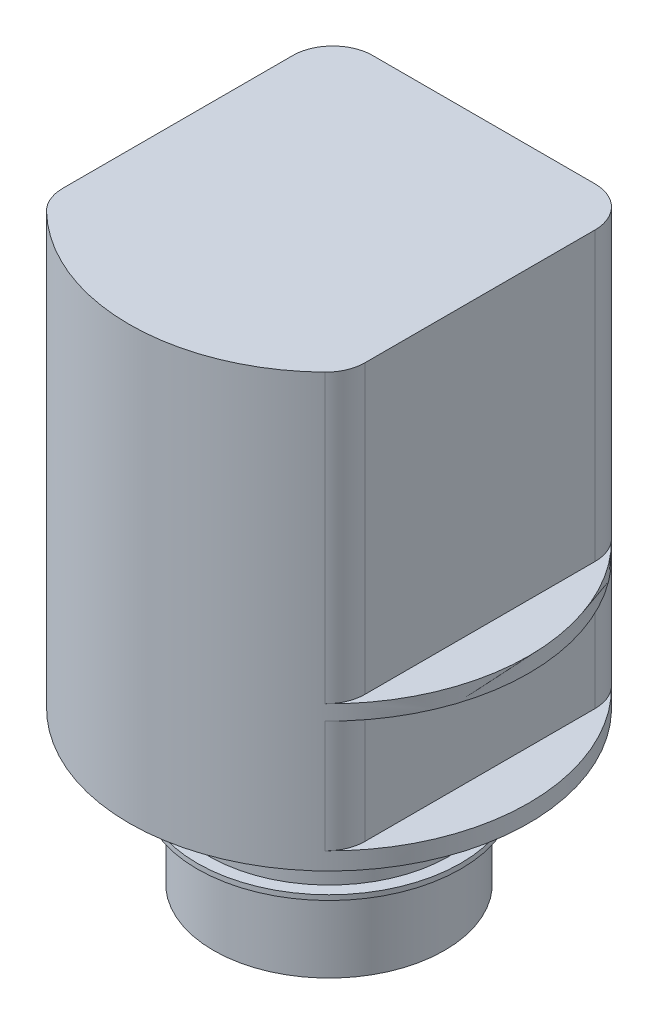
ISO-10303-21;
HEADER;
FILE_DESCRIPTION(('STEP AP214'),'2;1');
FILE_NAME('part.step','',(''),(''),'','','');
FILE_SCHEMA(('AUTOMOTIVE_DESIGN { 1 0 10303 214 1 1 1 1 }'));
ENDSEC;
DATA;
#1=APPLICATION_CONTEXT('core data for automotive mechanical design processes');
#2=APPLICATION_PROTOCOL_DEFINITION('international standard','automotive_design',2000,#1);
#3=PRODUCT_CONTEXT('',#1,'mechanical');
#4=PRODUCT('Part','Part','',(#3));
#5=PRODUCT_RELATED_PRODUCT_CATEGORY('part','',(#4));
#6=PRODUCT_DEFINITION_FORMATION('','',#4);
#7=PRODUCT_DEFINITION_CONTEXT('part definition',#1,'design');
#8=PRODUCT_DEFINITION('design','',#6,#7);
#9=PRODUCT_DEFINITION_SHAPE('','',#8);
#10=(LENGTH_UNIT() NAMED_UNIT(*) SI_UNIT(.MILLI.,.METRE.));
#11=(NAMED_UNIT(*) PLANE_ANGLE_UNIT() SI_UNIT($,.RADIAN.));
#12=(NAMED_UNIT(*) SI_UNIT($,.STERADIAN.) SOLID_ANGLE_UNIT());
#13=UNCERTAINTY_MEASURE_WITH_UNIT(LENGTH_MEASURE(1.E-05),#10,'distance_accuracy_value','');
#14=(GEOMETRIC_REPRESENTATION_CONTEXT(3) GLOBAL_UNCERTAINTY_ASSIGNED_CONTEXT((#13)) GLOBAL_UNIT_ASSIGNED_CONTEXT((#10,
#11,#12)) REPRESENTATION_CONTEXT('',''));
#15=CARTESIAN_POINT('',(0.,0.,0.));
#16=DIRECTION('',(0.,0.,1.));
#17=DIRECTION('',(1.,0.,0.));
#18=AXIS2_PLACEMENT_3D('',#15,#16,#17);
#19=CARTESIAN_POINT('',(0.,-17.272,0.));
#20=DIRECTION('',(0.,-1.,0.));
#21=DIRECTION('',(1.,0.,0.));
#22=AXIS2_PLACEMENT_3D('',#19,#20,#21);
#23=PLANE('',#22);
#24=CARTESIAN_POINT('',(0.,-17.272,0.));
#25=DIRECTION('',(0.,-1.,0.));
#26=DIRECTION('',(1.,0.,0.));
#27=AXIS2_PLACEMENT_3D('',#24,#25,#26);
#28=CIRCLE('',#27,11.7474999999999);
#29=CARTESIAN_POINT('',(11.7475,-17.2719999999999,0.));
#30=VERTEX_POINT('',#29);
#31=EDGE_CURVE('E20',#30,#30,#28,.F.);
#32=ORIENTED_EDGE('',*,*,#31,.F.);
#33=EDGE_LOOP('',(#32));
#34=FACE_BOUND('',#33,.T.);
#35=ADVANCED_FACE('F17',(#34),#23,.T.);
#36=CARTESIAN_POINT('',(3.49148133884313E-12,-1000.,0.));
#37=DIRECTION('',(0.,-1.,0.));
#38=DIRECTION('',(1.,0.,0.));
#39=AXIS2_PLACEMENT_3D('',#36,#37,#38);
#40=CYLINDRICAL_SURFACE('',#39,11.7474999999999);
#41=CARTESIAN_POINT('',(0.,-9.27100000000003,0.));
#42=DIRECTION('',(0.,-1.,0.));
#43=DIRECTION('',(1.,0.,0.));
#44=AXIS2_PLACEMENT_3D('',#41,#42,#43);
#45=CIRCLE('',#44,11.7474999999999);
#46=CARTESIAN_POINT('',(11.7475,-9.27099999999999,0.));
#47=VERTEX_POINT('',#46);
#48=EDGE_CURVE('E260',#47,#47,#45,.F.);
#49=ORIENTED_EDGE('',*,*,#48,.F.);
#50=EDGE_LOOP('',(#49));
#51=FACE_BOUND('',#50,.T.);
#52=ORIENTED_EDGE('',*,*,#31,.T.);
#53=EDGE_LOOP('',(#52));
#54=FACE_BOUND('',#53,.T.);
#55=ADVANCED_FACE('F267',(#51,#54),#40,.T.);
#56=CARTESIAN_POINT('',(13.3985,-9.27099999999999,0.));
#57=DIRECTION('',(0.,-1.,0.));
#58=DIRECTION('',(1.,0.,0.));
#59=AXIS2_PLACEMENT_3D('',#56,#57,#58);
#60=PLANE('',#59);
#61=ORIENTED_EDGE('',*,*,#48,.T.);
#62=EDGE_LOOP('',(#61));
#63=FACE_BOUND('',#62,.T.);
#64=CARTESIAN_POINT('',(0.,-9.27100000000003,0.));
#65=DIRECTION('',(0.,-1.,0.));
#66=DIRECTION('',(1.,0.,0.));
#67=AXIS2_PLACEMENT_3D('',#64,#65,#66);
#68=CIRCLE('',#67,13.3985);
#69=CARTESIAN_POINT('',(13.3985,-9.27099999999998,0.));
#70=VERTEX_POINT('',#69);
#71=EDGE_CURVE('E258',#70,#70,#68,.F.);
#72=ORIENTED_EDGE('',*,*,#71,.F.);
#73=EDGE_LOOP('',(#72));
#74=FACE_BOUND('',#73,.T.);
#75=ADVANCED_FACE('F274',(#63,#74),#60,.T.);
#76=CARTESIAN_POINT('',(3.49148133884313E-12,-1000.,0.));
#77=DIRECTION('',(0.,-1.,0.));
#78=DIRECTION('',(1.,0.,0.));
#79=AXIS2_PLACEMENT_3D('',#76,#77,#78);
#80=CYLINDRICAL_SURFACE('',#79,13.3985);
#81=CARTESIAN_POINT('',(0.,-8.76299999999997,0.));
#82=DIRECTION('',(0.,-1.,0.));
#83=DIRECTION('',(1.,0.,0.));
#84=AXIS2_PLACEMENT_3D('',#81,#82,#83);
#85=CIRCLE('',#84,13.3985);
#86=CARTESIAN_POINT('',(13.3985,-8.76299999999992,0.));
#87=VERTEX_POINT('',#86);
#88=EDGE_CURVE('E255',#87,#87,#85,.F.);
#89=ORIENTED_EDGE('',*,*,#88,.F.);
#90=EDGE_LOOP('',(#89));
#91=FACE_BOUND('',#90,.T.);
#92=ORIENTED_EDGE('',*,*,#71,.T.);
#93=EDGE_LOOP('',(#92));
#94=FACE_BOUND('',#93,.T.);
#95=ADVANCED_FACE('F372',(#91,#94),#80,.T.);
#96=CARTESIAN_POINT('',(13.3985,-8.763,0.));
#97=DIRECTION('',(0.,1.,0.));
#98=DIRECTION('',(-1.,0.,0.));
#99=AXIS2_PLACEMENT_3D('',#96,#97,#98);
#100=PLANE('',#99);
#101=ORIENTED_EDGE('',*,*,#88,.T.);
#102=EDGE_LOOP('',(#101));
#103=FACE_BOUND('',#102,.T.);
#104=CARTESIAN_POINT('',(0.,-8.76299999999997,0.));
#105=DIRECTION('',(0.,-1.,0.));
#106=DIRECTION('',(1.,0.,0.));
#107=AXIS2_PLACEMENT_3D('',#104,#105,#106);
#108=CIRCLE('',#107,12.192);
#109=CARTESIAN_POINT('',(12.192,-8.76299999999992,0.));
#110=VERTEX_POINT('',#109);
#111=EDGE_CURVE('E252',#110,#110,#108,.F.);
#112=ORIENTED_EDGE('',*,*,#111,.F.);
#113=EDGE_LOOP('',(#112));
#114=FACE_BOUND('',#113,.T.);
#115=ADVANCED_FACE('F368',(#103,#114),#100,.T.);
#116=CARTESIAN_POINT('',(3.49148133884313E-12,-1000.,0.));
#117=DIRECTION('',(0.,-1.,0.));
#118=DIRECTION('',(1.,0.,0.));
#119=AXIS2_PLACEMENT_3D('',#116,#117,#118);
#120=CYLINDRICAL_SURFACE('',#119,12.192);
#121=CARTESIAN_POINT('',(0.,-6.47699999999996,0.));
#122=DIRECTION('',(0.,-1.,0.));
#123=DIRECTION('',(1.,0.,0.));
#124=AXIS2_PLACEMENT_3D('',#121,#122,#123);
#125=CIRCLE('',#124,12.192);
#126=CARTESIAN_POINT('',(12.192,-6.47699999999991,0.));
#127=VERTEX_POINT('',#126);
#128=EDGE_CURVE('E249',#127,#127,#125,.F.);
#129=ORIENTED_EDGE('',*,*,#128,.F.);
#130=EDGE_LOOP('',(#129));
#131=FACE_BOUND('',#130,.T.);
#132=ORIENTED_EDGE('',*,*,#111,.T.);
#133=EDGE_LOOP('',(#132));
#134=FACE_BOUND('',#133,.T.);
#135=ADVANCED_FACE('F364',(#131,#134),#120,.T.);
#136=CARTESIAN_POINT('',(12.192,-6.477,0.));
#137=DIRECTION('',(0.,-1.,0.));
#138=DIRECTION('',(1.,0.,0.));
#139=AXIS2_PLACEMENT_3D('',#136,#137,#138);
#140=PLANE('',#139);
#141=ORIENTED_EDGE('',*,*,#128,.T.);
#142=EDGE_LOOP('',(#141));
#143=FACE_BOUND('',#142,.T.);
#144=CARTESIAN_POINT('',(0.,-6.47699999999996,0.));
#145=DIRECTION('',(0.,-1.,0.));
#146=DIRECTION('',(1.,0.,0.));
#147=AXIS2_PLACEMENT_3D('',#144,#145,#146);
#148=CIRCLE('',#147,13.3985);
#149=CARTESIAN_POINT('',(13.3985,-6.47699999999991,0.));
#150=VERTEX_POINT('',#149);
#151=EDGE_CURVE('E169',#150,#150,#148,.F.);
#152=ORIENTED_EDGE('',*,*,#151,.F.);
#153=EDGE_LOOP('',(#152));
#154=FACE_BOUND('',#153,.T.);
#155=ADVANCED_FACE('F360',(#143,#154),#140,.T.);
#156=CARTESIAN_POINT('',(3.49148133884313E-12,-1000.,0.));
#157=DIRECTION('',(0.,-1.,0.));
#158=DIRECTION('',(1.,0.,0.));
#159=AXIS2_PLACEMENT_3D('',#156,#157,#158);
#160=CYLINDRICAL_SURFACE('',#159,13.3985);
#161=ORIENTED_EDGE('',*,*,#151,.T.);
#162=EDGE_LOOP('',(#161));
#163=FACE_BOUND('',#162,.T.);
#164=CARTESIAN_POINT('',(0.,-1.77799999999995,0.));
#165=DIRECTION('',(0.,-1.,0.));
#166=DIRECTION('',(1.,0.,0.));
#167=AXIS2_PLACEMENT_3D('',#164,#165,#166);
#168=CIRCLE('',#167,13.3985);
#169=CARTESIAN_POINT('',(13.3985,-1.7779999999999,0.));
#170=VERTEX_POINT('',#169);
#171=EDGE_CURVE('E243',#170,#170,#168,.T.);
#172=ORIENTED_EDGE('',*,*,#171,.T.);
#173=EDGE_LOOP('',(#172));
#174=FACE_BOUND('',#173,.T.);
#175=ADVANCED_FACE('F356',(#163,#174),#160,.T.);
#176=CARTESIAN_POINT('',(15.3669999999999,42.164,-11.6828017801418));
#177=DIRECTION('',(-1.,0.,0.));
#178=DIRECTION('',(0.,0.,1.));
#179=AXIS2_PLACEMENT_3D('',#176,#177,#178);
#180=PLANE('',#179);
#181=DIRECTION('',(0.,-1.,0.));
#182=VECTOR('',#181,1.);
#183=CARTESIAN_POINT('',(15.367,42.164,11.7104103685568));
#184=LINE('',#183,#182);
#185=CARTESIAN_POINT('',(15.3669999999999,0.,11.7104103685568));
#186=VERTEX_POINT('',#185);
#187=CARTESIAN_POINT('',(15.3669999999999,11.43,11.7104103685568));
#188=VERTEX_POINT('',#187);
#189=EDGE_CURVE('E154',#186,#188,#184,.F.);
#190=ORIENTED_EDGE('',*,*,#189,.F.);
#191=DIRECTION('',(0.,0.,1.));
#192=VECTOR('',#191,1.);
#193=CARTESIAN_POINT('',(15.3669999999999,0.,0.));
#194=LINE('',#193,#192);
#195=CARTESIAN_POINT('',(15.3669999999999,0.,-11.6828017801418));
#196=VERTEX_POINT('',#195);
#197=EDGE_CURVE('E151',#196,#186,#194,.T.);
#198=ORIENTED_EDGE('',*,*,#197,.F.);
#199=DIRECTION('',(0.,-1.,0.));
#200=VECTOR('',#199,1.);
#201=CARTESIAN_POINT('',(15.3669999999999,42.164,-11.6828017801418));
#202=LINE('',#201,#200);
#203=CARTESIAN_POINT('',(15.3669999999999,11.43,-11.6828017801418));
#204=VERTEX_POINT('',#203);
#205=EDGE_CURVE('E175',#204,#196,#202,.T.);
#206=ORIENTED_EDGE('',*,*,#205,.F.);
#207=DIRECTION('',(0.,0.,1.));
#208=VECTOR('',#207,1.);
#209=CARTESIAN_POINT('',(15.3669999999999,11.43,-11.6828017801418));
#210=LINE('',#209,#208);
#211=EDGE_CURVE('E166',#204,#188,#210,.T.);
#212=ORIENTED_EDGE('',*,*,#211,.T.);
#213=EDGE_LOOP('',(#190,#198,#206,#212));
#214=FACE_BOUND('',#213,.T.);
#215=ADVANCED_FACE('F353',(#214),#180,.F.);
#216=CARTESIAN_POINT('',(0.,0.,0.));
#217=DIRECTION('',(0.,1.,0.));
#218=DIRECTION('',(0.,0.,1.));
#219=AXIS2_PLACEMENT_3D('',#216,#217,#218);
#220=PLANE('',#219);
#221=CARTESIAN_POINT('',(11.3018017801418,0.,-11.6828017801418));
#222=DIRECTION('',(0.,-1.,0.));
#223=DIRECTION('',(0.,0.,-1.));
#224=AXIS2_PLACEMENT_3D('',#221,#222,#223);
#225=CIRCLE('',#224,4.06519821985816);
#226=CARTESIAN_POINT('',(14.1282936130936,0.,-14.6045787197788));
#227=VERTEX_POINT('',#226);
#228=EDGE_CURVE('E177',#196,#227,#225,.F.);
#229=ORIENTED_EDGE('',*,*,#228,.F.);
#230=ORIENTED_EDGE('',*,*,#197,.T.);
#231=CARTESIAN_POINT('',(11.367,0.,11.7104103685568));
#232=DIRECTION('',(0.,-1.,0.));
#233=DIRECTION('',(0.,0.,-1.));
#234=AXIS2_PLACEMENT_3D('',#231,#232,#233);
#235=CIRCLE('',#234,4.00000000000001);
#236=CARTESIAN_POINT('',(14.1530294117646,0.,14.5806089883011));
#237=VERTEX_POINT('',#236);
#238=EDGE_CURVE('E148',#237,#186,#235,.F.);
#239=ORIENTED_EDGE('',*,*,#238,.F.);
#240=CARTESIAN_POINT('',(0.,0.,0.));
#241=DIRECTION('',(0.,-1.,0.));
#242=DIRECTION('',(0.,0.,-1.));
#243=AXIS2_PLACEMENT_3D('',#240,#241,#242);
#244=CIRCLE('',#243,20.32);
#245=EDGE_CURVE('E131',#227,#237,#244,.T.);
#246=ORIENTED_EDGE('',*,*,#245,.F.);
#247=EDGE_LOOP('',(#229,#230,#239,#246));
#248=FACE_BOUND('',#247,.T.);
#249=ADVANCED_FACE('F149',(#248),#220,.T.);
#250=CARTESIAN_POINT('',(11.367,42.164,11.7104103685568));
#251=DIRECTION('',(0.,-1.,0.));
#252=DIRECTION('',(0.,0.,-1.));
#253=AXIS2_PLACEMENT_3D('',#250,#251,#252);
#254=CYLINDRICAL_SURFACE('',#253,4.00000000000001);
#255=ORIENTED_EDGE('',*,*,#238,.T.);
#256=ORIENTED_EDGE('',*,*,#189,.T.);
#257=CARTESIAN_POINT('',(11.367,11.43,11.7104103685568));
#258=DIRECTION('',(0.,-1.,0.));
#259=DIRECTION('',(0.,0.,-1.));
#260=AXIS2_PLACEMENT_3D('',#257,#258,#259);
#261=CIRCLE('',#260,4.00000000000001);
#262=CARTESIAN_POINT('',(14.1530294117646,11.43,14.5806089883011));
#263=VERTEX_POINT('',#262);
#264=EDGE_CURVE('E158',#188,#263,#261,.T.);
#265=ORIENTED_EDGE('',*,*,#264,.T.);
#266=DIRECTION('',(0.,-1.,0.));
#267=VECTOR('',#266,1.);
#268=CARTESIAN_POINT('',(14.1530294117646,42.164,14.5806089883011));
#269=LINE('',#268,#267);
#270=EDGE_CURVE('E136',#237,#263,#269,.F.);
#271=ORIENTED_EDGE('',*,*,#270,.F.);
#272=EDGE_LOOP('',(#255,#256,#265,#271));
#273=FACE_BOUND('',#272,.T.);
#274=ADVANCED_FACE('F156',(#273),#254,.T.);
#275=CARTESIAN_POINT('',(-11.3018017801418,11.43,-11.6828017801418));
#276=DIRECTION('',(0.,1.,0.));
#277=DIRECTION('',(0.,0.,1.));
#278=AXIS2_PLACEMENT_3D('',#275,#276,#277);
#279=PLANE('',#278);
#280=ORIENTED_EDGE('',*,*,#264,.F.);
#281=ORIENTED_EDGE('',*,*,#211,.F.);
#282=CARTESIAN_POINT('',(11.3018017801418,11.43,-11.6828017801418));
#283=DIRECTION('',(0.,-1.,0.));
#284=DIRECTION('',(0.,0.,-1.));
#285=AXIS2_PLACEMENT_3D('',#282,#283,#284);
#286=CIRCLE('',#285,4.06519821985816);
#287=CARTESIAN_POINT('',(14.1282936130937,11.43,-14.6045787197789));
#288=VERTEX_POINT('',#287);
#289=EDGE_CURVE('E178',#288,#204,#286,.T.);
#290=ORIENTED_EDGE('',*,*,#289,.F.);
#291=CARTESIAN_POINT('',(0.,11.43,0.));
#292=DIRECTION('',(0.,-1.,0.));
#293=DIRECTION('',(0.,0.,-1.));
#294=AXIS2_PLACEMENT_3D('',#291,#292,#293);
#295=CIRCLE('',#294,20.32);
#296=EDGE_CURVE('E160',#263,#288,#295,.F.);
#297=ORIENTED_EDGE('',*,*,#296,.F.);
#298=EDGE_LOOP('',(#280,#281,#290,#297));
#299=FACE_BOUND('',#298,.T.);
#300=ADVANCED_FACE('F344',(#299),#279,.F.);
#301=CARTESIAN_POINT('',(-11.3018017801418,12.954,-11.6828017801418));
#302=DIRECTION('',(0.,1.,0.));
#303=DIRECTION('',(0.,0.,1.));
#304=AXIS2_PLACEMENT_3D('',#301,#302,#303);
#305=PLANE('',#304);
#306=CARTESIAN_POINT('',(11.3018017801418,12.954,-11.6828017801418));
#307=DIRECTION('',(0.,-1.,0.));
#308=DIRECTION('',(0.,0.,-1.));
#309=AXIS2_PLACEMENT_3D('',#306,#307,#308);
#310=CIRCLE('',#309,4.06519821985816);
#311=CARTESIAN_POINT('',(15.3669999999999,12.954,-11.6828017801418));
#312=VERTEX_POINT('',#311);
#313=CARTESIAN_POINT('',(14.1282936130936,12.954,-14.6045787197788));
#314=VERTEX_POINT('',#313);
#315=EDGE_CURVE('E235',#312,#314,#310,.F.);
#316=ORIENTED_EDGE('',*,*,#315,.F.);
#317=DIRECTION('',(0.,0.,1.));
#318=VECTOR('',#317,1.);
#319=CARTESIAN_POINT('',(15.3669999999999,12.954,-11.6828017801418));
#320=LINE('',#319,#318);
#321=CARTESIAN_POINT('',(15.367,12.954,11.7104103685568));
#322=VERTEX_POINT('',#321);
#323=EDGE_CURVE('E170',#312,#322,#320,.T.);
#324=ORIENTED_EDGE('',*,*,#323,.T.);
#325=CARTESIAN_POINT('',(11.367,12.954,11.7104103685568));
#326=DIRECTION('',(0.,-1.,0.));
#327=DIRECTION('',(0.,0.,-1.));
#328=AXIS2_PLACEMENT_3D('',#325,#326,#327);
#329=CIRCLE('',#328,4.00000000000001);
#330=CARTESIAN_POINT('',(14.1530294117646,12.954,14.5806089883011));
#331=VERTEX_POINT('',#330);
#332=EDGE_CURVE('E173',#331,#322,#329,.F.);
#333=ORIENTED_EDGE('',*,*,#332,.F.);
#334=CARTESIAN_POINT('',(0.,12.954,0.));
#335=DIRECTION('',(0.,-1.,0.));
#336=DIRECTION('',(0.,0.,-1.));
#337=AXIS2_PLACEMENT_3D('',#334,#335,#336);
#338=CIRCLE('',#337,20.32);
#339=EDGE_CURVE('E226',#314,#331,#338,.T.);
#340=ORIENTED_EDGE('',*,*,#339,.F.);
#341=EDGE_LOOP('',(#316,#324,#333,#340));
#342=FACE_BOUND('',#341,.T.);
#343=ADVANCED_FACE('F340',(#342),#305,.T.);
#344=CARTESIAN_POINT('',(-11.3669999999999,42.164,11.7104103685568));
#345=DIRECTION('',(0.,-1.,0.));
#346=DIRECTION('',(0.,0.,-1.));
#347=AXIS2_PLACEMENT_3D('',#344,#345,#346);
#348=CYLINDRICAL_SURFACE('',#347,4.);
#349=CARTESIAN_POINT('',(-11.3669999999999,0.,11.7104103685568));
#350=DIRECTION('',(0.,-1.,0.));
#351=DIRECTION('',(0.,0.,-1.));
#352=AXIS2_PLACEMENT_3D('',#349,#350,#351);
#353=CIRCLE('',#352,4.);
#354=CARTESIAN_POINT('',(-14.1530294117646,0.,14.5806089883011));
#355=VERTEX_POINT('',#354);
#356=CARTESIAN_POINT('',(-15.3669999999999,0.,11.7104103685568));
#357=VERTEX_POINT('',#356);
#358=EDGE_CURVE('E183',#355,#357,#353,.T.);
#359=ORIENTED_EDGE('',*,*,#358,.F.);
#360=DIRECTION('',(0.,-1.,0.));
#361=VECTOR('',#360,1.);
#362=CARTESIAN_POINT('',(-14.1530294117646,42.164,14.5806089883011));
#363=LINE('',#362,#361);
#364=CARTESIAN_POINT('',(-14.1530294117646,11.43,14.5806089883011));
#365=VERTEX_POINT('',#364);
#366=EDGE_CURVE('E219',#365,#355,#363,.T.);
#367=ORIENTED_EDGE('',*,*,#366,.F.);
#368=CARTESIAN_POINT('',(-11.3669999999999,11.43,11.7104103685568));
#369=DIRECTION('',(0.,-1.,0.));
#370=DIRECTION('',(0.,0.,-1.));
#371=AXIS2_PLACEMENT_3D('',#368,#369,#370);
#372=CIRCLE('',#371,4.);
#373=CARTESIAN_POINT('',(-15.3669999999999,11.43,11.7104103685568));
#374=VERTEX_POINT('',#373);
#375=EDGE_CURVE('E238',#365,#374,#372,.T.);
#376=ORIENTED_EDGE('',*,*,#375,.T.);
#377=DIRECTION('',(0.,1.,0.));
#378=VECTOR('',#377,1.);
#379=CARTESIAN_POINT('',(-15.3669999999999,42.164,11.7104103685568));
#380=LINE('',#379,#378);
#381=EDGE_CURVE('E179',#374,#357,#380,.F.);
#382=ORIENTED_EDGE('',*,*,#381,.T.);
#383=EDGE_LOOP('',(#359,#367,#376,#382));
#384=FACE_BOUND('',#383,.T.);
#385=ADVANCED_FACE('F336',(#384),#348,.T.);
#386=CARTESIAN_POINT('',(0.,-1.778,0.));
#387=DIRECTION('',(0.,1.,0.));
#388=DIRECTION('',(0.,0.,1.));
#389=AXIS2_PLACEMENT_3D('',#386,#387,#388);
#390=PLANE('',#389);
#391=CARTESIAN_POINT('',(0.,-1.778,0.));
#392=DIRECTION('',(0.,-1.,0.));
#393=DIRECTION('',(0.,0.,-1.));
#394=AXIS2_PLACEMENT_3D('',#391,#392,#393);
#395=CIRCLE('',#394,20.32);
#396=CARTESIAN_POINT('',(0.,-1.778,-20.32));
#397=VERTEX_POINT('',#396);
#398=EDGE_CURVE('E213',#397,#397,#395,.F.);
#399=ORIENTED_EDGE('',*,*,#398,.F.);
#400=EDGE_LOOP('',(#399));
#401=FACE_BOUND('',#400,.T.);
#402=ORIENTED_EDGE('',*,*,#171,.F.);
#403=EDGE_LOOP('',(#402));
#404=FACE_BOUND('',#403,.T.);
#405=ADVANCED_FACE('F332',(#401,#404),#390,.F.);
#406=CARTESIAN_POINT('',(0.,0.,0.));
#407=DIRECTION('',(0.,1.,0.));
#408=DIRECTION('',(0.,0.,1.));
#409=AXIS2_PLACEMENT_3D('',#406,#407,#408);
#410=PLANE('',#409);
#411=CARTESIAN_POINT('',(-11.3018017801418,0.,-11.6828017801418));
#412=DIRECTION('',(0.,-1.,0.));
#413=DIRECTION('',(0.,0.,-1.));
#414=AXIS2_PLACEMENT_3D('',#411,#412,#413);
#415=CIRCLE('',#414,4.06519821985816);
#416=CARTESIAN_POINT('',(-11.3018017801418,0.,-15.748));
#417=VERTEX_POINT('',#416);
#418=CARTESIAN_POINT('',(-14.1282936130937,0.,-14.6045787197788));
#419=VERTEX_POINT('',#418);
#420=EDGE_CURVE('E206',#417,#419,#415,.F.);
#421=ORIENTED_EDGE('',*,*,#420,.F.);
#422=DIRECTION('',(1.,0.,0.));
#423=VECTOR('',#422,1.);
#424=CARTESIAN_POINT('',(-11.3018017801418,0.,-15.748));
#425=LINE('',#424,#423);
#426=CARTESIAN_POINT('',(11.3018017801418,0.,-15.748));
#427=VERTEX_POINT('',#426);
#428=EDGE_CURVE('E237',#417,#427,#425,.T.);
#429=ORIENTED_EDGE('',*,*,#428,.T.);
#430=CARTESIAN_POINT('',(11.3018017801418,0.,-11.6828017801418));
#431=DIRECTION('',(0.,-1.,0.));
#432=DIRECTION('',(0.,0.,-1.));
#433=AXIS2_PLACEMENT_3D('',#430,#431,#432);
#434=CIRCLE('',#433,4.06519821985816);
#435=EDGE_CURVE('E229',#227,#427,#434,.F.);
#436=ORIENTED_EDGE('',*,*,#435,.F.);
#437=CARTESIAN_POINT('',(0.,0.,0.));
#438=DIRECTION('',(0.,-1.,0.));
#439=DIRECTION('',(0.,0.,-1.));
#440=AXIS2_PLACEMENT_3D('',#437,#438,#439);
#441=CIRCLE('',#440,20.32);
#442=EDGE_CURVE('E139',#419,#227,#441,.T.);
#443=ORIENTED_EDGE('',*,*,#442,.F.);
#444=EDGE_LOOP('',(#421,#429,#436,#443));
#445=FACE_BOUND('',#444,.T.);
#446=ADVANCED_FACE('F328',(#445),#410,.T.);
#447=CARTESIAN_POINT('',(0.,0.,0.));
#448=DIRECTION('',(0.,1.,0.));
#449=DIRECTION('',(0.,0.,1.));
#450=AXIS2_PLACEMENT_3D('',#447,#448,#449);
#451=PLANE('',#450);
#452=ORIENTED_EDGE('',*,*,#358,.T.);
#453=DIRECTION('',(0.,0.,-1.));
#454=VECTOR('',#453,1.);
#455=CARTESIAN_POINT('',(-15.367,0.,-11.6828017801418));
#456=LINE('',#455,#454);
#457=CARTESIAN_POINT('',(-15.367,0.,-11.6828017801418));
#458=VERTEX_POINT('',#457);
#459=EDGE_CURVE('E182',#357,#458,#456,.T.);
#460=ORIENTED_EDGE('',*,*,#459,.T.);
#461=CARTESIAN_POINT('',(-11.3018017801418,0.,-11.6828017801418));
#462=DIRECTION('',(0.,-1.,0.));
#463=DIRECTION('',(0.,0.,-1.));
#464=AXIS2_PLACEMENT_3D('',#461,#462,#463);
#465=CIRCLE('',#464,4.06519821985816);
#466=EDGE_CURVE('E204',#419,#458,#465,.F.);
#467=ORIENTED_EDGE('',*,*,#466,.F.);
#468=CARTESIAN_POINT('',(0.,0.,0.));
#469=DIRECTION('',(0.,-1.,0.));
#470=DIRECTION('',(0.,0.,-1.));
#471=AXIS2_PLACEMENT_3D('',#468,#469,#470);
#472=CIRCLE('',#471,20.32);
#473=EDGE_CURVE('E217',#355,#419,#472,.T.);
#474=ORIENTED_EDGE('',*,*,#473,.F.);
#475=EDGE_LOOP('',(#452,#460,#467,#474));
#476=FACE_BOUND('',#475,.T.);
#477=ADVANCED_FACE('F324',(#476),#451,.T.);
#478=CARTESIAN_POINT('',(-15.367,42.164,-11.6828017801418));
#479=DIRECTION('',(1.,0.,0.));
#480=DIRECTION('',(0.,0.,-1.));
#481=AXIS2_PLACEMENT_3D('',#478,#479,#480);
#482=PLANE('',#481);
#483=DIRECTION('',(0.,-1.,0.));
#484=VECTOR('',#483,1.);
#485=CARTESIAN_POINT('',(-15.367,42.164,-11.6828017801418));
#486=LINE('',#485,#484);
#487=CARTESIAN_POINT('',(-15.3669999999999,11.43,-11.6828017801418));
#488=VERTEX_POINT('',#487);
#489=EDGE_CURVE('E203',#458,#488,#486,.F.);
#490=ORIENTED_EDGE('',*,*,#489,.F.);
#491=ORIENTED_EDGE('',*,*,#459,.F.);
#492=ORIENTED_EDGE('',*,*,#381,.F.);
#493=DIRECTION('',(0.,0.,1.));
#494=VECTOR('',#493,1.);
#495=CARTESIAN_POINT('',(-15.3669999999999,11.43,-11.6828017801418));
#496=LINE('',#495,#494);
#497=EDGE_CURVE('E241',#374,#488,#496,.F.);
#498=ORIENTED_EDGE('',*,*,#497,.T.);
#499=EDGE_LOOP('',(#490,#491,#492,#498));
#500=FACE_BOUND('',#499,.T.);
#501=ADVANCED_FACE('F320',(#500),#482,.F.);
#502=CARTESIAN_POINT('',(-11.3018017801418,11.43,-11.6828017801418));
#503=DIRECTION('',(0.,1.,0.));
#504=DIRECTION('',(0.,0.,1.));
#505=AXIS2_PLACEMENT_3D('',#502,#503,#504);
#506=PLANE('',#505);
#507=CARTESIAN_POINT('',(-11.3018017801418,11.43,-11.6828017801418));
#508=DIRECTION('',(0.,-1.,0.));
#509=DIRECTION('',(0.,0.,-1.));
#510=AXIS2_PLACEMENT_3D('',#507,#508,#509);
#511=CIRCLE('',#510,4.06519821985816);
#512=CARTESIAN_POINT('',(-14.1282936130937,11.43,-14.6045787197788));
#513=VERTEX_POINT('',#512);
#514=EDGE_CURVE('E201',#488,#513,#511,.T.);
#515=ORIENTED_EDGE('',*,*,#514,.F.);
#516=ORIENTED_EDGE('',*,*,#497,.F.);
#517=ORIENTED_EDGE('',*,*,#375,.F.);
#518=CARTESIAN_POINT('',(0.,11.43,0.));
#519=DIRECTION('',(0.,-1.,0.));
#520=DIRECTION('',(0.,0.,-1.));
#521=AXIS2_PLACEMENT_3D('',#518,#519,#520);
#522=CIRCLE('',#521,20.32);
#523=EDGE_CURVE('E220',#513,#365,#522,.F.);
#524=ORIENTED_EDGE('',*,*,#523,.F.);
#525=EDGE_LOOP('',(#515,#516,#517,#524));
#526=FACE_BOUND('',#525,.T.);
#527=ADVANCED_FACE('F316',(#526),#506,.F.);
#528=CARTESIAN_POINT('',(-11.3018017801418,12.954,-11.6828017801418));
#529=DIRECTION('',(0.,1.,0.));
#530=DIRECTION('',(0.,0.,1.));
#531=AXIS2_PLACEMENT_3D('',#528,#529,#530);
#532=PLANE('',#531);
#533=CARTESIAN_POINT('',(-11.3669999999999,12.954,11.7104103685568));
#534=DIRECTION('',(0.,-1.,0.));
#535=DIRECTION('',(0.,0.,-1.));
#536=AXIS2_PLACEMENT_3D('',#533,#534,#535);
#537=CIRCLE('',#536,4.);
#538=CARTESIAN_POINT('',(-15.3669999999999,12.954,11.7104103685568));
#539=VERTEX_POINT('',#538);
#540=CARTESIAN_POINT('',(-14.1530294117646,12.954,14.5806089883011));
#541=VERTEX_POINT('',#540);
#542=EDGE_CURVE('E210',#539,#541,#537,.F.);
#543=ORIENTED_EDGE('',*,*,#542,.F.);
#544=DIRECTION('',(0.,0.,-1.));
#545=VECTOR('',#544,1.);
#546=CARTESIAN_POINT('',(-15.367,12.954,-11.6828017801418));
#547=LINE('',#546,#545);
#548=CARTESIAN_POINT('',(-15.367,12.954,-11.6828017801418));
#549=VERTEX_POINT('',#548);
#550=EDGE_CURVE('E588',#539,#549,#547,.T.);
#551=ORIENTED_EDGE('',*,*,#550,.T.);
#552=CARTESIAN_POINT('',(-11.3018017801418,12.954,-11.6828017801418));
#553=DIRECTION('',(0.,-1.,0.));
#554=DIRECTION('',(0.,0.,-1.));
#555=AXIS2_PLACEMENT_3D('',#552,#553,#554);
#556=CIRCLE('',#555,4.06519821985816);
#557=CARTESIAN_POINT('',(-14.1282936130937,12.954,-14.6045787197788));
#558=VERTEX_POINT('',#557);
#559=EDGE_CURVE('E198',#558,#549,#556,.F.);
#560=ORIENTED_EDGE('',*,*,#559,.F.);
#561=CARTESIAN_POINT('',(0.,12.954,0.));
#562=DIRECTION('',(0.,-1.,0.));
#563=DIRECTION('',(0.,0.,-1.));
#564=AXIS2_PLACEMENT_3D('',#561,#562,#563);
#565=CIRCLE('',#564,20.32);
#566=EDGE_CURVE('E223',#541,#558,#565,.T.);
#567=ORIENTED_EDGE('',*,*,#566,.F.);
#568=EDGE_LOOP('',(#543,#551,#560,#567));
#569=FACE_BOUND('',#568,.T.);
#570=ADVANCED_FACE('F312',(#569),#532,.T.);
#571=CARTESIAN_POINT('',(-11.3018017801418,42.164,-15.748));
#572=DIRECTION('',(0.,0.,1.));
#573=DIRECTION('',(1.,0.,0.));
#574=AXIS2_PLACEMENT_3D('',#571,#572,#573);
#575=PLANE('',#574);
#576=ORIENTED_EDGE('',*,*,#428,.F.);
#577=DIRECTION('',(0.,-1.,0.));
#578=VECTOR('',#577,1.);
#579=CARTESIAN_POINT('',(-11.3018017801418,42.164,-15.748));
#580=LINE('',#579,#578);
#581=CARTESIAN_POINT('',(-11.3018017801418,42.164,-15.748));
#582=VERTEX_POINT('',#581);
#583=EDGE_CURVE('E209',#582,#417,#580,.T.);
#584=ORIENTED_EDGE('',*,*,#583,.F.);
#585=DIRECTION('',(1.,0.,0.));
#586=VECTOR('',#585,1.);
#587=CARTESIAN_POINT('',(-11.3018017801418,42.164,-15.748));
#588=LINE('',#587,#586);
#589=CARTESIAN_POINT('',(11.3018017801418,42.164,-15.748));
#590=VERTEX_POINT('',#589);
#591=EDGE_CURVE('E197',#582,#590,#588,.T.);
#592=ORIENTED_EDGE('',*,*,#591,.T.);
#593=DIRECTION('',(0.,-1.,0.));
#594=VECTOR('',#593,1.);
#595=CARTESIAN_POINT('',(11.3018017801418,42.164,-15.748));
#596=LINE('',#595,#594);
#597=EDGE_CURVE('E231',#427,#590,#596,.F.);
#598=ORIENTED_EDGE('',*,*,#597,.F.);
#599=EDGE_LOOP('',(#576,#584,#592,#598));
#600=FACE_BOUND('',#599,.T.);
#601=ADVANCED_FACE('F308',(#600),#575,.F.);
#602=CARTESIAN_POINT('',(11.3018017801418,42.164,-11.6828017801418));
#603=DIRECTION('',(0.,-1.,0.));
#604=DIRECTION('',(0.,0.,-1.));
#605=AXIS2_PLACEMENT_3D('',#602,#603,#604);
#606=CYLINDRICAL_SURFACE('',#605,4.06519821985816);
#607=CARTESIAN_POINT('',(11.3018017801418,42.164,-11.6828017801418));
#608=DIRECTION('',(0.,-1.,0.));
#609=DIRECTION('',(0.,0.,-1.));
#610=AXIS2_PLACEMENT_3D('',#607,#608,#609);
#611=CIRCLE('',#610,4.06519821985816);
#612=CARTESIAN_POINT('',(15.3669999999999,42.164,-11.6828017801418));
#613=VERTEX_POINT('',#612);
#614=EDGE_CURVE('E194',#590,#613,#611,.T.);
#615=ORIENTED_EDGE('',*,*,#614,.T.);
#616=DIRECTION('',(0.,1.,0.));
#617=VECTOR('',#616,1.);
#618=CARTESIAN_POINT('',(15.3669999999999,42.164,-11.6828017801418));
#619=LINE('',#618,#617);
#620=EDGE_CURVE('E174',#613,#312,#619,.F.);
#621=ORIENTED_EDGE('',*,*,#620,.T.);
#622=ORIENTED_EDGE('',*,*,#315,.T.);
#623=DIRECTION('',(0.,-1.,0.));
#624=VECTOR('',#623,1.);
#625=CARTESIAN_POINT('',(14.1282936130937,42.164,-14.6045787197789));
#626=LINE('',#625,#624);
#627=EDGE_CURVE('E162',#288,#314,#626,.F.);
#628=ORIENTED_EDGE('',*,*,#627,.F.);
#629=ORIENTED_EDGE('',*,*,#289,.T.);
#630=ORIENTED_EDGE('',*,*,#205,.T.);
#631=ORIENTED_EDGE('',*,*,#228,.T.);
#632=ORIENTED_EDGE('',*,*,#435,.T.);
#633=ORIENTED_EDGE('',*,*,#597,.T.);
#634=EDGE_LOOP('',(#615,#621,#622,#628,#629,#630,#631,#632,#633));
#635=FACE_BOUND('',#634,.T.);
#636=ADVANCED_FACE('F304',(#635),#606,.T.);
#637=CARTESIAN_POINT('',(15.3669999999999,42.164,-11.6828017801418));
#638=DIRECTION('',(-1.,0.,0.));
#639=DIRECTION('',(0.,0.,1.));
#640=AXIS2_PLACEMENT_3D('',#637,#638,#639);
#641=PLANE('',#640);
#642=ORIENTED_EDGE('',*,*,#323,.F.);
#643=ORIENTED_EDGE('',*,*,#620,.F.);
#644=DIRECTION('',(0.,0.,-1.));
#645=VECTOR('',#644,1.);
#646=CARTESIAN_POINT('',(15.3669999999999,42.164,-11.6828017801418));
#647=LINE('',#646,#645);
#648=CARTESIAN_POINT('',(15.3669999999999,42.164,11.7104103685568));
#649=VERTEX_POINT('',#648);
#650=EDGE_CURVE('E193',#613,#649,#647,.F.);
#651=ORIENTED_EDGE('',*,*,#650,.T.);
#652=DIRECTION('',(0.,-1.,0.));
#653=VECTOR('',#652,1.);
#654=CARTESIAN_POINT('',(15.367,42.164,11.7104103685568));
#655=LINE('',#654,#653);
#656=EDGE_CURVE('E144',#322,#649,#655,.F.);
#657=ORIENTED_EDGE('',*,*,#656,.F.);
#658=EDGE_LOOP('',(#642,#643,#651,#657));
#659=FACE_BOUND('',#658,.T.);
#660=ADVANCED_FACE('F300',(#659),#641,.F.);
#661=CARTESIAN_POINT('',(11.367,42.164,11.7104103685568));
#662=DIRECTION('',(0.,-1.,0.));
#663=DIRECTION('',(0.,0.,-1.));
#664=AXIS2_PLACEMENT_3D('',#661,#662,#663);
#665=CYLINDRICAL_SURFACE('',#664,4.00000000000001);
#666=ORIENTED_EDGE('',*,*,#656,.T.);
#667=CARTESIAN_POINT('',(11.367,42.164,11.7104103685568));
#668=DIRECTION('',(0.,-1.,0.));
#669=DIRECTION('',(0.,0.,-1.));
#670=AXIS2_PLACEMENT_3D('',#667,#668,#669);
#671=CIRCLE('',#670,4.00000000000001);
#672=CARTESIAN_POINT('',(14.1530294117646,42.164,14.5806089883011));
#673=VERTEX_POINT('',#672);
#674=EDGE_CURVE('E190',#649,#673,#671,.T.);
#675=ORIENTED_EDGE('',*,*,#674,.T.);
#676=DIRECTION('',(0.,-1.,0.));
#677=VECTOR('',#676,1.);
#678=CARTESIAN_POINT('',(14.1530294117646,42.164,14.5806089883011));
#679=LINE('',#678,#677);
#680=EDGE_CURVE('E225',#331,#673,#679,.F.);
#681=ORIENTED_EDGE('',*,*,#680,.F.);
#682=ORIENTED_EDGE('',*,*,#332,.T.);
#683=EDGE_LOOP('',(#666,#675,#681,#682));
#684=FACE_BOUND('',#683,.T.);
#685=ADVANCED_FACE('F297',(#684),#665,.T.);
#686=CARTESIAN_POINT('',(0.,42.164,0.));
#687=DIRECTION('',(0.,-1.,0.));
#688=DIRECTION('',(0.,0.,-1.));
#689=AXIS2_PLACEMENT_3D('',#686,#687,#688);
#690=CYLINDRICAL_SURFACE('',#689,20.32);
#691=CARTESIAN_POINT('',(0.,42.164,0.));
#692=DIRECTION('',(0.,-1.,0.));
#693=DIRECTION('',(0.,0.,-1.));
#694=AXIS2_PLACEMENT_3D('',#691,#692,#693);
#695=CIRCLE('',#694,20.32);
#696=CARTESIAN_POINT('',(-14.1530294117646,42.164,14.5806089883011));
#697=VERTEX_POINT('',#696);
#698=EDGE_CURVE('E188',#673,#697,#695,.T.);
#699=ORIENTED_EDGE('',*,*,#698,.T.);
#700=DIRECTION('',(0.,-1.,0.));
#701=VECTOR('',#700,1.);
#702=CARTESIAN_POINT('',(-14.1530294117646,42.164,14.5806089883011));
#703=LINE('',#702,#701);
#704=EDGE_CURVE('E212',#541,#697,#703,.F.);
#705=ORIENTED_EDGE('',*,*,#704,.F.);
#706=ORIENTED_EDGE('',*,*,#566,.T.);
#707=DIRECTION('',(0.,-1.,0.));
#708=VECTOR('',#707,1.);
#709=CARTESIAN_POINT('',(-14.1282936130937,42.164,-14.6045787197788));
#710=LINE('',#709,#708);
#711=EDGE_CURVE('E200',#513,#558,#710,.F.);
#712=ORIENTED_EDGE('',*,*,#711,.F.);
#713=ORIENTED_EDGE('',*,*,#523,.T.);
#714=ORIENTED_EDGE('',*,*,#366,.T.);
#715=ORIENTED_EDGE('',*,*,#473,.T.);
#716=ORIENTED_EDGE('',*,*,#442,.T.);
#717=ORIENTED_EDGE('',*,*,#245,.T.);
#718=ORIENTED_EDGE('',*,*,#270,.T.);
#719=ORIENTED_EDGE('',*,*,#296,.T.);
#720=ORIENTED_EDGE('',*,*,#627,.T.);
#721=ORIENTED_EDGE('',*,*,#339,.T.);
#722=ORIENTED_EDGE('',*,*,#680,.T.);
#723=EDGE_LOOP('',(#699,#705,#706,#712,#713,#714,#715,#716,#717,#718,#719,#720,#721,#722));
#724=FACE_BOUND('',#723,.T.);
#725=ORIENTED_EDGE('',*,*,#398,.T.);
#726=EDGE_LOOP('',(#725));
#727=FACE_BOUND('',#726,.T.);
#728=ADVANCED_FACE('F133',(#724,#727),#690,.T.);
#729=CARTESIAN_POINT('',(-11.3669999999999,42.164,11.7104103685568));
#730=DIRECTION('',(0.,-1.,0.));
#731=DIRECTION('',(0.,0.,-1.));
#732=AXIS2_PLACEMENT_3D('',#729,#730,#731);
#733=CYLINDRICAL_SURFACE('',#732,4.);
#734=ORIENTED_EDGE('',*,*,#704,.T.);
#735=CARTESIAN_POINT('',(-11.3669999999999,42.164,11.7104103685568));
#736=DIRECTION('',(0.,-1.,0.));
#737=DIRECTION('',(0.,0.,-1.));
#738=AXIS2_PLACEMENT_3D('',#735,#736,#737);
#739=CIRCLE('',#738,4.);
#740=CARTESIAN_POINT('',(-15.3669999999999,42.164,11.7104103685568));
#741=VERTEX_POINT('',#740);
#742=EDGE_CURVE('E185',#697,#741,#739,.T.);
#743=ORIENTED_EDGE('',*,*,#742,.T.);
#744=DIRECTION('',(0.,1.,0.));
#745=VECTOR('',#744,1.);
#746=CARTESIAN_POINT('',(-15.3669999999999,42.164,11.7104103685568));
#747=LINE('',#746,#745);
#748=EDGE_CURVE('E591',#741,#539,#747,.F.);
#749=ORIENTED_EDGE('',*,*,#748,.T.);
#750=ORIENTED_EDGE('',*,*,#542,.T.);
#751=EDGE_LOOP('',(#734,#743,#749,#750));
#752=FACE_BOUND('',#751,.T.);
#753=ADVANCED_FACE('F290',(#752),#733,.T.);
#754=CARTESIAN_POINT('',(-15.367,42.164,-11.6828017801418));
#755=DIRECTION('',(1.,0.,0.));
#756=DIRECTION('',(0.,0.,-1.));
#757=AXIS2_PLACEMENT_3D('',#754,#755,#756);
#758=PLANE('',#757);
#759=ORIENTED_EDGE('',*,*,#550,.F.);
#760=ORIENTED_EDGE('',*,*,#748,.F.);
#761=DIRECTION('',(0.,0.,-1.));
#762=VECTOR('',#761,1.);
#763=CARTESIAN_POINT('',(-15.3669999999999,42.164,-11.6828017801418));
#764=LINE('',#763,#762);
#765=CARTESIAN_POINT('',(-15.3669999999999,42.164,-11.6828017801418));
#766=VERTEX_POINT('',#765);
#767=EDGE_CURVE('E26',#741,#766,#764,.T.);
#768=ORIENTED_EDGE('',*,*,#767,.T.);
#769=DIRECTION('',(0.,-1.,0.));
#770=VECTOR('',#769,1.);
#771=CARTESIAN_POINT('',(-15.367,42.164,-11.6828017801418));
#772=LINE('',#771,#770);
#773=EDGE_CURVE('E34',#549,#766,#772,.F.);
#774=ORIENTED_EDGE('',*,*,#773,.F.);
#775=EDGE_LOOP('',(#759,#760,#768,#774));
#776=FACE_BOUND('',#775,.T.);
#777=ADVANCED_FACE('F284',(#776),#758,.F.);
#778=CARTESIAN_POINT('',(-11.3018017801418,42.164,-11.6828017801418));
#779=DIRECTION('',(0.,-1.,0.));
#780=DIRECTION('',(0.,0.,-1.));
#781=AXIS2_PLACEMENT_3D('',#778,#779,#780);
#782=CYLINDRICAL_SURFACE('',#781,4.06519821985816);
#783=ORIENTED_EDGE('',*,*,#773,.T.);
#784=CARTESIAN_POINT('',(-11.3018017801418,42.164,-11.6828017801418));
#785=DIRECTION('',(0.,-1.,0.));
#786=DIRECTION('',(0.,0.,-1.));
#787=AXIS2_PLACEMENT_3D('',#784,#785,#786);
#788=CIRCLE('',#787,4.06519821985816);
#789=EDGE_CURVE('E11',#766,#582,#788,.T.);
#790=ORIENTED_EDGE('',*,*,#789,.T.);
#791=ORIENTED_EDGE('',*,*,#583,.T.);
#792=ORIENTED_EDGE('',*,*,#420,.T.);
#793=ORIENTED_EDGE('',*,*,#466,.T.);
#794=ORIENTED_EDGE('',*,*,#489,.T.);
#795=ORIENTED_EDGE('',*,*,#514,.T.);
#796=ORIENTED_EDGE('',*,*,#711,.T.);
#797=ORIENTED_EDGE('',*,*,#559,.T.);
#798=EDGE_LOOP('',(#783,#790,#791,#792,#793,#794,#795,#796,#797));
#799=FACE_BOUND('',#798,.T.);
#800=ADVANCED_FACE('F278',(#799),#782,.T.);
#801=CARTESIAN_POINT('',(-11.3018017801418,42.164,-11.6828017801418));
#802=DIRECTION('',(0.,-1.,0.));
#803=DIRECTION('',(0.,0.,-1.));
#804=AXIS2_PLACEMENT_3D('',#801,#802,#803);
#805=PLANE('',#804);
#806=ORIENTED_EDGE('',*,*,#767,.F.);
#807=ORIENTED_EDGE('',*,*,#742,.F.);
#808=ORIENTED_EDGE('',*,*,#698,.F.);
#809=ORIENTED_EDGE('',*,*,#674,.F.);
#810=ORIENTED_EDGE('',*,*,#650,.F.);
#811=ORIENTED_EDGE('',*,*,#614,.F.);
#812=ORIENTED_EDGE('',*,*,#591,.F.);
#813=ORIENTED_EDGE('',*,*,#789,.F.);
#814=EDGE_LOOP('',(#806,#807,#808,#809,#810,#811,#812,#813));
#815=FACE_BOUND('',#814,.T.);
#816=ADVANCED_FACE('F276',(#815),#805,.F.);
#817=CLOSED_SHELL('',(#35,#55,#75,#95,#115,#135,#155,#175,#215,#249,#274,#300,#343,#385,#405,
#446,#477,#501,#527,#570,#601,#636,#660,#685,#728,#753,#777,#800,#816));
#818=MANIFOLD_SOLID_BREP('B1',#817);
#819=ADVANCED_BREP_SHAPE_REPRESENTATION('',(#18,#818),#14);
#820=SHAPE_DEFINITION_REPRESENTATION(#9,#819);
ENDSEC;
END-ISO-10303-21;
